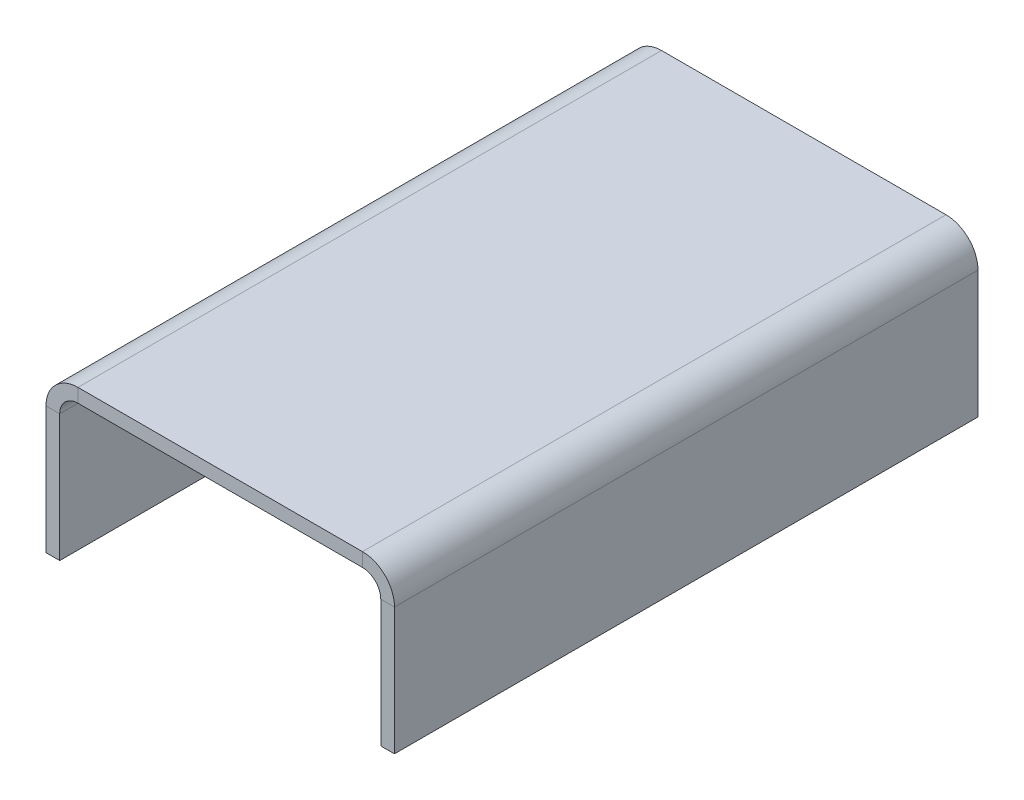
ISO-10303-21;
HEADER;
FILE_DESCRIPTION(('STEP AP214'),'2;1');
FILE_NAME('part.step','',(''),(''),'','','');
FILE_SCHEMA(('AUTOMOTIVE_DESIGN { 1 0 10303 214 1 1 1 1 }'));
ENDSEC;
DATA;
#1=APPLICATION_CONTEXT('core data for automotive mechanical design processes');
#2=APPLICATION_PROTOCOL_DEFINITION('international standard','automotive_design',2000,#1);
#3=PRODUCT_CONTEXT('',#1,'mechanical');
#4=PRODUCT('Part','Part','',(#3));
#5=PRODUCT_RELATED_PRODUCT_CATEGORY('part','',(#4));
#6=PRODUCT_DEFINITION_FORMATION('','',#4);
#7=PRODUCT_DEFINITION_CONTEXT('part definition',#1,'design');
#8=PRODUCT_DEFINITION('design','',#6,#7);
#9=PRODUCT_DEFINITION_SHAPE('','',#8);
#10=(LENGTH_UNIT() NAMED_UNIT(*) SI_UNIT(.MILLI.,.METRE.));
#11=(NAMED_UNIT(*) PLANE_ANGLE_UNIT() SI_UNIT($,.RADIAN.));
#12=(NAMED_UNIT(*) SI_UNIT($,.STERADIAN.) SOLID_ANGLE_UNIT());
#13=UNCERTAINTY_MEASURE_WITH_UNIT(LENGTH_MEASURE(1.E-05),#10,'distance_accuracy_value','');
#14=(GEOMETRIC_REPRESENTATION_CONTEXT(3) GLOBAL_UNCERTAINTY_ASSIGNED_CONTEXT((#13)) GLOBAL_UNIT_ASSIGNED_CONTEXT((#10,
#11,#12)) REPRESENTATION_CONTEXT('',''));
#15=CARTESIAN_POINT('',(0.,0.,0.));
#16=DIRECTION('',(0.,0.,1.));
#17=DIRECTION('',(1.,0.,0.));
#18=AXIS2_PLACEMENT_3D('',#15,#16,#17);
#19=CARTESIAN_POINT('',(-31.1,17.4,63.8));
#20=DIRECTION('',(0.,0.,1.));
#21=DIRECTION('',(1.,0.,0.));
#22=AXIS2_PLACEMENT_3D('',#19,#20,#21);
#23=PLANE('',#22);
#24=DIRECTION('',(0.,-1.,0.));
#25=VECTOR('',#24,1.);
#26=CARTESIAN_POINT('',(-31.1,17.4,63.8));
#27=LINE('',#26,#25);
#28=CARTESIAN_POINT('',(-31.1,17.4,63.8));
#29=VERTEX_POINT('',#28);
#30=CARTESIAN_POINT('',(-31.1,14.4,63.8));
#31=VERTEX_POINT('',#30);
#32=EDGE_CURVE('E11',#29,#31,#27,.T.);
#33=ORIENTED_EDGE('',*,*,#32,.F.);
#34=CARTESIAN_POINT('',(-31.1,10.4,63.8));
#35=DIRECTION('',(0.,0.,1.));
#36=DIRECTION('',(1.,0.,0.));
#37=AXIS2_PLACEMENT_3D('',#34,#35,#36);
#38=CIRCLE('',#37,7.);
#39=CARTESIAN_POINT('',(-38.1,10.4,63.8));
#40=VERTEX_POINT('',#39);
#41=EDGE_CURVE('E172',#29,#40,#38,.T.);
#42=ORIENTED_EDGE('',*,*,#41,.T.);
#43=DIRECTION('',(-1.,0.,0.));
#44=VECTOR('',#43,1.);
#45=CARTESIAN_POINT('',(-35.1,10.4,63.8));
#46=LINE('',#45,#44);
#47=CARTESIAN_POINT('',(-35.1,10.4,63.8));
#48=VERTEX_POINT('',#47);
#49=EDGE_CURVE('E47',#48,#40,#46,.T.);
#50=ORIENTED_EDGE('',*,*,#49,.F.);
#51=CARTESIAN_POINT('',(-31.1,10.4,63.8));
#52=DIRECTION('',(0.,0.,1.));
#53=DIRECTION('',(1.,0.,0.));
#54=AXIS2_PLACEMENT_3D('',#51,#52,#53);
#55=CIRCLE('',#54,4.);
#56=EDGE_CURVE('E248',#31,#48,#55,.T.);
#57=ORIENTED_EDGE('',*,*,#56,.F.);
#58=EDGE_LOOP('',(#33,#42,#50,#57));
#59=FACE_BOUND('',#58,.T.);
#60=ADVANCED_FACE('F39',(#59),#23,.T.);
#61=CARTESIAN_POINT('',(-35.1,10.4,63.8));
#62=DIRECTION('',(0.,0.,1.));
#63=DIRECTION('',(1.,0.,0.));
#64=AXIS2_PLACEMENT_3D('',#61,#62,#63);
#65=PLANE('',#64);
#66=DIRECTION('',(-1.,0.,0.));
#67=VECTOR('',#66,1.);
#68=CARTESIAN_POINT('',(-38.1,17.4,63.8));
#69=LINE('',#68,#67);
#70=CARTESIAN_POINT('',(31.0999999999999,17.4,63.8));
#71=VERTEX_POINT('',#70);
#72=EDGE_CURVE('E139',#71,#29,#69,.T.);
#73=ORIENTED_EDGE('',*,*,#72,.T.);
#74=ORIENTED_EDGE('',*,*,#32,.T.);
#75=DIRECTION('',(-1.,0.,0.));
#76=VECTOR('',#75,1.);
#77=CARTESIAN_POINT('',(-38.1,14.4,63.8));
#78=LINE('',#77,#76);
#79=CARTESIAN_POINT('',(31.0999999999999,14.4,63.8));
#80=VERTEX_POINT('',#79);
#81=EDGE_CURVE('E142',#80,#31,#78,.T.);
#82=ORIENTED_EDGE('',*,*,#81,.F.);
#83=DIRECTION('',(0.,1.,0.));
#84=VECTOR('',#83,1.);
#85=CARTESIAN_POINT('',(31.0999999999999,14.4,63.8));
#86=LINE('',#85,#84);
#87=EDGE_CURVE('E135',#80,#71,#86,.T.);
#88=ORIENTED_EDGE('',*,*,#87,.T.);
#89=EDGE_LOOP('',(#73,#74,#82,#88));
#90=FACE_BOUND('',#89,.T.);
#91=ADVANCED_FACE('F137',(#90),#65,.T.);
#92=CARTESIAN_POINT('',(-38.1,10.4,-63.8));
#93=DIRECTION('',(0.,0.,-1.));
#94=DIRECTION('',(-1.,0.,0.));
#95=AXIS2_PLACEMENT_3D('',#92,#93,#94);
#96=PLANE('',#95);
#97=DIRECTION('',(1.,0.,0.));
#98=VECTOR('',#97,1.);
#99=CARTESIAN_POINT('',(-38.1,10.4,-63.8));
#100=LINE('',#99,#98);
#101=CARTESIAN_POINT('',(-38.1,10.4,-63.8));
#102=VERTEX_POINT('',#101);
#103=CARTESIAN_POINT('',(-35.1,10.4,-63.8));
#104=VERTEX_POINT('',#103);
#105=EDGE_CURVE('E102',#102,#104,#100,.T.);
#106=ORIENTED_EDGE('',*,*,#105,.F.);
#107=CARTESIAN_POINT('',(-31.1,10.4,-63.8));
#108=DIRECTION('',(0.,0.,1.));
#109=DIRECTION('',(1.,0.,0.));
#110=AXIS2_PLACEMENT_3D('',#107,#108,#109);
#111=CIRCLE('',#110,7.);
#112=CARTESIAN_POINT('',(-31.1,17.4,-63.8));
#113=VERTEX_POINT('',#112);
#114=EDGE_CURVE('E206',#113,#102,#111,.T.);
#115=ORIENTED_EDGE('',*,*,#114,.F.);
#116=DIRECTION('',(0.,1.,0.));
#117=VECTOR('',#116,1.);
#118=CARTESIAN_POINT('',(-31.1,14.4,-63.8));
#119=LINE('',#118,#117);
#120=CARTESIAN_POINT('',(-31.1,14.4,-63.8));
#121=VERTEX_POINT('',#120);
#122=EDGE_CURVE('E95',#121,#113,#119,.T.);
#123=ORIENTED_EDGE('',*,*,#122,.F.);
#124=CARTESIAN_POINT('',(-31.1,10.4,-63.8));
#125=DIRECTION('',(0.,0.,1.));
#126=DIRECTION('',(1.,0.,0.));
#127=AXIS2_PLACEMENT_3D('',#124,#125,#126);
#128=CIRCLE('',#127,4.);
#129=EDGE_CURVE('E187',#121,#104,#128,.T.);
#130=ORIENTED_EDGE('',*,*,#129,.T.);
#131=EDGE_LOOP('',(#106,#115,#123,#130));
#132=FACE_BOUND('',#131,.T.);
#133=ADVANCED_FACE('F253',(#132),#96,.T.);
#134=CARTESIAN_POINT('',(-31.1,14.4,-63.8));
#135=DIRECTION('',(0.,0.,-1.));
#136=DIRECTION('',(-1.,0.,0.));
#137=AXIS2_PLACEMENT_3D('',#134,#135,#136);
#138=PLANE('',#137);
#139=DIRECTION('',(0.,-1.,0.));
#140=VECTOR('',#139,1.);
#141=CARTESIAN_POINT('',(-38.1,-17.4,-63.8));
#142=LINE('',#141,#140);
#143=CARTESIAN_POINT('',(-38.1,-17.4,-63.8));
#144=VERTEX_POINT('',#143);
#145=EDGE_CURVE('E178',#102,#144,#142,.T.);
#146=ORIENTED_EDGE('',*,*,#145,.F.);
#147=ORIENTED_EDGE('',*,*,#105,.T.);
#148=DIRECTION('',(0.,1.,0.));
#149=VECTOR('',#148,1.);
#150=CARTESIAN_POINT('',(-35.1,-17.4,-63.8));
#151=LINE('',#150,#149);
#152=CARTESIAN_POINT('',(-35.1,-17.4,-63.8));
#153=VERTEX_POINT('',#152);
#154=EDGE_CURVE('E184',#104,#153,#151,.F.);
#155=ORIENTED_EDGE('',*,*,#154,.T.);
#156=DIRECTION('',(-1.,0.,0.));
#157=VECTOR('',#156,1.);
#158=CARTESIAN_POINT('',(-35.1,-17.4,-63.8));
#159=LINE('',#158,#157);
#160=EDGE_CURVE('E181',#153,#144,#159,.T.);
#161=ORIENTED_EDGE('',*,*,#160,.T.);
#162=EDGE_LOOP('',(#146,#147,#155,#161));
#163=FACE_BOUND('',#162,.T.);
#164=ADVANCED_FACE('F239',(#163),#138,.T.);
#165=CARTESIAN_POINT('',(38.1,10.4,63.8));
#166=DIRECTION('',(0.,0.,1.));
#167=DIRECTION('',(1.,0.,0.));
#168=AXIS2_PLACEMENT_3D('',#165,#166,#167);
#169=PLANE('',#168);
#170=DIRECTION('',(-1.,0.,0.));
#171=VECTOR('',#170,1.);
#172=CARTESIAN_POINT('',(38.1,10.4,63.8));
#173=LINE('',#172,#171);
#174=CARTESIAN_POINT('',(38.1,10.4,63.8));
#175=VERTEX_POINT('',#174);
#176=CARTESIAN_POINT('',(35.1,10.4,63.8));
#177=VERTEX_POINT('',#176);
#178=EDGE_CURVE('E147',#175,#177,#173,.T.);
#179=ORIENTED_EDGE('',*,*,#178,.F.);
#180=CARTESIAN_POINT('',(31.1,10.4,63.8));
#181=DIRECTION('',(0.,0.,1.));
#182=DIRECTION('',(1.,0.,0.));
#183=AXIS2_PLACEMENT_3D('',#180,#181,#182);
#184=CIRCLE('',#183,7.);
#185=EDGE_CURVE('E151',#175,#71,#184,.T.);
#186=ORIENTED_EDGE('',*,*,#185,.T.);
#187=ORIENTED_EDGE('',*,*,#87,.F.);
#188=CARTESIAN_POINT('',(31.1,10.4,63.8));
#189=DIRECTION('',(0.,0.,1.));
#190=DIRECTION('',(1.,0.,0.));
#191=AXIS2_PLACEMENT_3D('',#188,#189,#190);
#192=CIRCLE('',#191,4.);
#193=EDGE_CURVE('E260',#177,#80,#192,.T.);
#194=ORIENTED_EDGE('',*,*,#193,.F.);
#195=EDGE_LOOP('',(#179,#186,#187,#194));
#196=FACE_BOUND('',#195,.T.);
#197=ADVANCED_FACE('F153',(#196),#169,.T.);
#198=CARTESIAN_POINT('',(31.0999999999999,14.4,63.8));
#199=DIRECTION('',(0.,0.,1.));
#200=DIRECTION('',(1.,0.,0.));
#201=AXIS2_PLACEMENT_3D('',#198,#199,#200);
#202=PLANE('',#201);
#203=DIRECTION('',(0.,1.,0.));
#204=VECTOR('',#203,1.);
#205=CARTESIAN_POINT('',(38.1,-17.4,63.8));
#206=LINE('',#205,#204);
#207=CARTESIAN_POINT('',(38.1,-17.4,63.8));
#208=VERTEX_POINT('',#207);
#209=EDGE_CURVE('E157',#208,#175,#206,.T.);
#210=ORIENTED_EDGE('',*,*,#209,.T.);
#211=ORIENTED_EDGE('',*,*,#178,.T.);
#212=DIRECTION('',(0.,1.,0.));
#213=VECTOR('',#212,1.);
#214=CARTESIAN_POINT('',(35.1,-17.4,63.8));
#215=LINE('',#214,#213);
#216=CARTESIAN_POINT('',(35.1,-17.4,63.8));
#217=VERTEX_POINT('',#216);
#218=EDGE_CURVE('E267',#217,#177,#215,.T.);
#219=ORIENTED_EDGE('',*,*,#218,.F.);
#220=DIRECTION('',(-1.,0.,0.));
#221=VECTOR('',#220,1.);
#222=CARTESIAN_POINT('',(38.1,-17.4,63.8));
#223=LINE('',#222,#221);
#224=EDGE_CURVE('E270',#208,#217,#223,.T.);
#225=ORIENTED_EDGE('',*,*,#224,.F.);
#226=EDGE_LOOP('',(#210,#211,#219,#225));
#227=FACE_BOUND('',#226,.T.);
#228=ADVANCED_FACE('F276',(#227),#202,.T.);
#229=CARTESIAN_POINT('',(31.0999999999999,17.4,-63.8));
#230=DIRECTION('',(0.,0.,-1.));
#231=DIRECTION('',(-1.,0.,0.));
#232=AXIS2_PLACEMENT_3D('',#229,#230,#231);
#233=PLANE('',#232);
#234=DIRECTION('',(0.,-1.,0.));
#235=VECTOR('',#234,1.);
#236=CARTESIAN_POINT('',(31.0999999999999,17.4,-63.8));
#237=LINE('',#236,#235);
#238=CARTESIAN_POINT('',(31.0999999999999,17.4,-63.8));
#239=VERTEX_POINT('',#238);
#240=CARTESIAN_POINT('',(31.0999999999999,14.4,-63.8));
#241=VERTEX_POINT('',#240);
#242=EDGE_CURVE('E148',#239,#241,#237,.T.);
#243=ORIENTED_EDGE('',*,*,#242,.F.);
#244=CARTESIAN_POINT('',(31.1,10.4,-63.8));
#245=DIRECTION('',(0.,0.,1.));
#246=DIRECTION('',(1.,0.,0.));
#247=AXIS2_PLACEMENT_3D('',#244,#245,#246);
#248=CIRCLE('',#247,7.);
#249=CARTESIAN_POINT('',(38.1,10.4,-63.8));
#250=VERTEX_POINT('',#249);
#251=EDGE_CURVE('E164',#250,#239,#248,.T.);
#252=ORIENTED_EDGE('',*,*,#251,.F.);
#253=DIRECTION('',(1.,0.,0.));
#254=VECTOR('',#253,1.);
#255=CARTESIAN_POINT('',(35.1,10.4,-63.8));
#256=LINE('',#255,#254);
#257=CARTESIAN_POINT('',(35.1,10.4,-63.8));
#258=VERTEX_POINT('',#257);
#259=EDGE_CURVE('E232',#258,#250,#256,.T.);
#260=ORIENTED_EDGE('',*,*,#259,.F.);
#261=CARTESIAN_POINT('',(31.1,10.4,-63.8));
#262=DIRECTION('',(0.,0.,1.));
#263=DIRECTION('',(1.,0.,0.));
#264=AXIS2_PLACEMENT_3D('',#261,#262,#263);
#265=CIRCLE('',#264,4.);
#266=EDGE_CURVE('E191',#258,#241,#265,.T.);
#267=ORIENTED_EDGE('',*,*,#266,.T.);
#268=EDGE_LOOP('',(#243,#252,#260,#267));
#269=FACE_BOUND('',#268,.T.);
#270=ADVANCED_FACE('F283',(#269),#233,.T.);
#271=CARTESIAN_POINT('',(35.1,10.4,-63.8));
#272=DIRECTION('',(0.,0.,-1.));
#273=DIRECTION('',(-1.,0.,0.));
#274=AXIS2_PLACEMENT_3D('',#271,#272,#273);
#275=PLANE('',#274);
#276=DIRECTION('',(-1.,0.,0.));
#277=VECTOR('',#276,1.);
#278=CARTESIAN_POINT('',(-38.1,17.4,-63.8));
#279=LINE('',#278,#277);
#280=EDGE_CURVE('E204',#239,#113,#279,.T.);
#281=ORIENTED_EDGE('',*,*,#280,.F.);
#282=ORIENTED_EDGE('',*,*,#242,.T.);
#283=DIRECTION('',(-1.,0.,0.));
#284=VECTOR('',#283,1.);
#285=CARTESIAN_POINT('',(-38.1,14.4,-63.8));
#286=LINE('',#285,#284);
#287=EDGE_CURVE('E189',#241,#121,#286,.T.);
#288=ORIENTED_EDGE('',*,*,#287,.T.);
#289=ORIENTED_EDGE('',*,*,#122,.T.);
#290=EDGE_LOOP('',(#281,#282,#288,#289));
#291=FACE_BOUND('',#290,.T.);
#292=ADVANCED_FACE('F285',(#291),#275,.T.);
#293=CARTESIAN_POINT('',(-38.1,-17.4,63.8));
#294=DIRECTION('',(1.,0.,0.));
#295=DIRECTION('',(0.,0.,-1.));
#296=AXIS2_PLACEMENT_3D('',#293,#294,#295);
#297=PLANE('',#296);
#298=ORIENTED_EDGE('',*,*,#145,.T.);
#299=DIRECTION('',(0.,0.,-1.));
#300=VECTOR('',#299,1.);
#301=CARTESIAN_POINT('',(-38.1,-17.4,63.8));
#302=LINE('',#301,#300);
#303=CARTESIAN_POINT('',(-38.1,-17.4,63.8));
#304=VERTEX_POINT('',#303);
#305=EDGE_CURVE('E230',#304,#144,#302,.T.);
#306=ORIENTED_EDGE('',*,*,#305,.F.);
#307=DIRECTION('',(0.,-1.,0.));
#308=VECTOR('',#307,1.);
#309=CARTESIAN_POINT('',(-38.1,-17.4,63.8));
#310=LINE('',#309,#308);
#311=EDGE_CURVE('E108',#40,#304,#310,.T.);
#312=ORIENTED_EDGE('',*,*,#311,.F.);
#313=DIRECTION('',(0.,0.,-1.));
#314=VECTOR('',#313,1.);
#315=CARTESIAN_POINT('',(-38.1,10.4,63.8));
#316=LINE('',#315,#314);
#317=EDGE_CURVE('E174',#40,#102,#316,.T.);
#318=ORIENTED_EDGE('',*,*,#317,.T.);
#319=EDGE_LOOP('',(#298,#306,#312,#318));
#320=FACE_BOUND('',#319,.T.);
#321=ADVANCED_FACE('F324',(#320),#297,.F.);
#322=CARTESIAN_POINT('',(-35.1,-17.4,63.8));
#323=DIRECTION('',(0.,-1.,0.));
#324=DIRECTION('',(0.,0.,-1.));
#325=AXIS2_PLACEMENT_3D('',#322,#323,#324);
#326=PLANE('',#325);
#327=ORIENTED_EDGE('',*,*,#160,.F.);
#328=DIRECTION('',(0.,0.,-1.));
#329=VECTOR('',#328,1.);
#330=CARTESIAN_POINT('',(-35.1,-17.4,63.8));
#331=LINE('',#330,#329);
#332=CARTESIAN_POINT('',(-35.1,-17.4,63.8));
#333=VERTEX_POINT('',#332);
#334=EDGE_CURVE('E228',#333,#153,#331,.T.);
#335=ORIENTED_EDGE('',*,*,#334,.F.);
#336=DIRECTION('',(-1.,0.,0.));
#337=VECTOR('',#336,1.);
#338=CARTESIAN_POINT('',(-35.1,-17.4,63.8));
#339=LINE('',#338,#337);
#340=EDGE_CURVE('E262',#333,#304,#339,.T.);
#341=ORIENTED_EDGE('',*,*,#340,.T.);
#342=ORIENTED_EDGE('',*,*,#305,.T.);
#343=EDGE_LOOP('',(#327,#335,#341,#342));
#344=FACE_BOUND('',#343,.T.);
#345=ADVANCED_FACE('F327',(#344),#326,.T.);
#346=CARTESIAN_POINT('',(-35.1,-17.4,63.8));
#347=DIRECTION('',(1.,0.,0.));
#348=DIRECTION('',(0.,0.,-1.));
#349=AXIS2_PLACEMENT_3D('',#346,#347,#348);
#350=PLANE('',#349);
#351=ORIENTED_EDGE('',*,*,#154,.F.);
#352=DIRECTION('',(0.,0.,-1.));
#353=VECTOR('',#352,1.);
#354=CARTESIAN_POINT('',(-35.1,10.4,63.8));
#355=LINE('',#354,#353);
#356=EDGE_CURVE('E225',#48,#104,#355,.T.);
#357=ORIENTED_EDGE('',*,*,#356,.F.);
#358=DIRECTION('',(0.,1.,0.));
#359=VECTOR('',#358,1.);
#360=CARTESIAN_POINT('',(-35.1,-17.4,63.8));
#361=LINE('',#360,#359);
#362=EDGE_CURVE('E258',#48,#333,#361,.F.);
#363=ORIENTED_EDGE('',*,*,#362,.T.);
#364=ORIENTED_EDGE('',*,*,#334,.T.);
#365=EDGE_LOOP('',(#351,#357,#363,#364));
#366=FACE_BOUND('',#365,.T.);
#367=ADVANCED_FACE('F251',(#366),#350,.T.);
#368=CARTESIAN_POINT('',(-31.1,10.4,63.8));
#369=DIRECTION('',(0.,0.,-1.));
#370=DIRECTION('',(-1.,0.,0.));
#371=AXIS2_PLACEMENT_3D('',#368,#369,#370);
#372=CYLINDRICAL_SURFACE('',#371,4.);
#373=ORIENTED_EDGE('',*,*,#129,.F.);
#374=DIRECTION('',(0.,0.,-1.));
#375=VECTOR('',#374,1.);
#376=CARTESIAN_POINT('',(-31.1,14.4,63.8));
#377=LINE('',#376,#375);
#378=EDGE_CURVE('E222',#31,#121,#377,.T.);
#379=ORIENTED_EDGE('',*,*,#378,.F.);
#380=ORIENTED_EDGE('',*,*,#56,.T.);
#381=ORIENTED_EDGE('',*,*,#356,.T.);
#382=EDGE_LOOP('',(#373,#379,#380,#381));
#383=FACE_BOUND('',#382,.T.);
#384=ADVANCED_FACE('F245',(#383),#372,.F.);
#385=CARTESIAN_POINT('',(-38.1,14.4,63.8));
#386=DIRECTION('',(0.,-1.,0.));
#387=DIRECTION('',(1.,0.,0.));
#388=AXIS2_PLACEMENT_3D('',#385,#386,#387);
#389=PLANE('',#388);
#390=ORIENTED_EDGE('',*,*,#287,.F.);
#391=DIRECTION('',(0.,0.,-1.));
#392=VECTOR('',#391,1.);
#393=CARTESIAN_POINT('',(31.0999999999999,14.4,63.8));
#394=LINE('',#393,#392);
#395=EDGE_CURVE('E219',#80,#241,#394,.T.);
#396=ORIENTED_EDGE('',*,*,#395,.F.);
#397=ORIENTED_EDGE('',*,*,#81,.T.);
#398=ORIENTED_EDGE('',*,*,#378,.T.);
#399=EDGE_LOOP('',(#390,#396,#397,#398));
#400=FACE_BOUND('',#399,.T.);
#401=ADVANCED_FACE('F256',(#400),#389,.T.);
#402=CARTESIAN_POINT('',(31.1,10.4,63.8));
#403=DIRECTION('',(0.,0.,-1.));
#404=DIRECTION('',(-1.,0.,0.));
#405=AXIS2_PLACEMENT_3D('',#402,#403,#404);
#406=CYLINDRICAL_SURFACE('',#405,4.);
#407=ORIENTED_EDGE('',*,*,#266,.F.);
#408=DIRECTION('',(0.,0.,-1.));
#409=VECTOR('',#408,1.);
#410=CARTESIAN_POINT('',(35.1,10.4,63.8));
#411=LINE('',#410,#409);
#412=EDGE_CURVE('E216',#177,#258,#411,.T.);
#413=ORIENTED_EDGE('',*,*,#412,.F.);
#414=ORIENTED_EDGE('',*,*,#193,.T.);
#415=ORIENTED_EDGE('',*,*,#395,.T.);
#416=EDGE_LOOP('',(#407,#413,#414,#415));
#417=FACE_BOUND('',#416,.T.);
#418=ADVANCED_FACE('F287',(#417),#406,.F.);
#419=CARTESIAN_POINT('',(35.1,-17.4,63.8));
#420=DIRECTION('',(-1.,0.,0.));
#421=DIRECTION('',(0.,-1.,0.));
#422=AXIS2_PLACEMENT_3D('',#419,#420,#421);
#423=PLANE('',#422);
#424=DIRECTION('',(0.,1.,0.));
#425=VECTOR('',#424,1.);
#426=CARTESIAN_POINT('',(35.1,-17.4,-63.8));
#427=LINE('',#426,#425);
#428=CARTESIAN_POINT('',(35.1,-17.4,-63.8));
#429=VERTEX_POINT('',#428);
#430=EDGE_CURVE('E194',#429,#258,#427,.T.);
#431=ORIENTED_EDGE('',*,*,#430,.F.);
#432=DIRECTION('',(0.,0.,-1.));
#433=VECTOR('',#432,1.);
#434=CARTESIAN_POINT('',(35.1,-17.4,63.8));
#435=LINE('',#434,#433);
#436=EDGE_CURVE('E214',#217,#429,#435,.T.);
#437=ORIENTED_EDGE('',*,*,#436,.F.);
#438=ORIENTED_EDGE('',*,*,#218,.T.);
#439=ORIENTED_EDGE('',*,*,#412,.T.);
#440=EDGE_LOOP('',(#431,#437,#438,#439));
#441=FACE_BOUND('',#440,.T.);
#442=ADVANCED_FACE('F290',(#441),#423,.T.);
#443=CARTESIAN_POINT('',(38.1,-17.4,63.8));
#444=DIRECTION('',(0.,-1.,0.));
#445=DIRECTION('',(0.,0.,-1.));
#446=AXIS2_PLACEMENT_3D('',#443,#444,#445);
#447=PLANE('',#446);
#448=DIRECTION('',(-1.,0.,0.));
#449=VECTOR('',#448,1.);
#450=CARTESIAN_POINT('',(38.1,-17.4,-63.8));
#451=LINE('',#450,#449);
#452=CARTESIAN_POINT('',(38.1,-17.4,-63.8));
#453=VERTEX_POINT('',#452);
#454=EDGE_CURVE('E197',#453,#429,#451,.T.);
#455=ORIENTED_EDGE('',*,*,#454,.F.);
#456=DIRECTION('',(0.,0.,-1.));
#457=VECTOR('',#456,1.);
#458=CARTESIAN_POINT('',(38.1,-17.4,63.8));
#459=LINE('',#458,#457);
#460=EDGE_CURVE('E212',#208,#453,#459,.T.);
#461=ORIENTED_EDGE('',*,*,#460,.F.);
#462=ORIENTED_EDGE('',*,*,#224,.T.);
#463=ORIENTED_EDGE('',*,*,#436,.T.);
#464=EDGE_LOOP('',(#455,#461,#462,#463));
#465=FACE_BOUND('',#464,.T.);
#466=ADVANCED_FACE('F293',(#465),#447,.T.);
#467=CARTESIAN_POINT('',(38.1,-17.4,63.8));
#468=DIRECTION('',(-1.,0.,0.));
#469=DIRECTION('',(0.,-1.,0.));
#470=AXIS2_PLACEMENT_3D('',#467,#468,#469);
#471=PLANE('',#470);
#472=DIRECTION('',(0.,1.,0.));
#473=VECTOR('',#472,1.);
#474=CARTESIAN_POINT('',(38.1,-17.4,-63.8));
#475=LINE('',#474,#473);
#476=EDGE_CURVE('E200',#453,#250,#475,.T.);
#477=ORIENTED_EDGE('',*,*,#476,.T.);
#478=DIRECTION('',(0.,0.,-1.));
#479=VECTOR('',#478,1.);
#480=CARTESIAN_POINT('',(38.1,10.4,63.8));
#481=LINE('',#480,#479);
#482=EDGE_CURVE('E166',#175,#250,#481,.T.);
#483=ORIENTED_EDGE('',*,*,#482,.F.);
#484=ORIENTED_EDGE('',*,*,#209,.F.);
#485=ORIENTED_EDGE('',*,*,#460,.T.);
#486=EDGE_LOOP('',(#477,#483,#484,#485));
#487=FACE_BOUND('',#486,.T.);
#488=ADVANCED_FACE('F280',(#487),#471,.F.);
#489=CARTESIAN_POINT('',(31.1,10.4,63.8));
#490=DIRECTION('',(0.,0.,-1.));
#491=DIRECTION('',(-1.,0.,0.));
#492=AXIS2_PLACEMENT_3D('',#489,#490,#491);
#493=CYLINDRICAL_SURFACE('',#492,7.);
#494=ORIENTED_EDGE('',*,*,#251,.T.);
#495=DIRECTION('',(0.,0.,-1.));
#496=VECTOR('',#495,1.);
#497=CARTESIAN_POINT('',(31.0999999999999,17.4,63.8));
#498=LINE('',#497,#496);
#499=EDGE_CURVE('E161',#71,#239,#498,.T.);
#500=ORIENTED_EDGE('',*,*,#499,.F.);
#501=ORIENTED_EDGE('',*,*,#185,.F.);
#502=ORIENTED_EDGE('',*,*,#482,.T.);
#503=EDGE_LOOP('',(#494,#500,#501,#502));
#504=FACE_BOUND('',#503,.T.);
#505=ADVANCED_FACE('F162',(#504),#493,.T.);
#506=CARTESIAN_POINT('',(-38.1,17.4,63.8));
#507=DIRECTION('',(0.,-1.,0.));
#508=DIRECTION('',(1.,0.,0.));
#509=AXIS2_PLACEMENT_3D('',#506,#507,#508);
#510=PLANE('',#509);
#511=ORIENTED_EDGE('',*,*,#280,.T.);
#512=DIRECTION('',(0.,0.,-1.));
#513=VECTOR('',#512,1.);
#514=CARTESIAN_POINT('',(-31.1,17.4,63.8));
#515=LINE('',#514,#513);
#516=EDGE_CURVE('E167',#29,#113,#515,.T.);
#517=ORIENTED_EDGE('',*,*,#516,.F.);
#518=ORIENTED_EDGE('',*,*,#72,.F.);
#519=ORIENTED_EDGE('',*,*,#499,.T.);
#520=EDGE_LOOP('',(#511,#517,#518,#519));
#521=FACE_BOUND('',#520,.T.);
#522=ADVANCED_FACE('F169',(#521),#510,.F.);
#523=CARTESIAN_POINT('',(-31.1,10.4,63.8));
#524=DIRECTION('',(0.,0.,-1.));
#525=DIRECTION('',(-1.,0.,0.));
#526=AXIS2_PLACEMENT_3D('',#523,#524,#525);
#527=CYLINDRICAL_SURFACE('',#526,7.);
#528=ORIENTED_EDGE('',*,*,#114,.T.);
#529=ORIENTED_EDGE('',*,*,#317,.F.);
#530=ORIENTED_EDGE('',*,*,#41,.F.);
#531=ORIENTED_EDGE('',*,*,#516,.T.);
#532=EDGE_LOOP('',(#528,#529,#530,#531));
#533=FACE_BOUND('',#532,.T.);
#534=ADVANCED_FACE('F302',(#533),#527,.T.);
#535=CARTESIAN_POINT('',(-31.1,10.4,63.8));
#536=DIRECTION('',(0.,0.,1.));
#537=DIRECTION('',(1.,0.,0.));
#538=AXIS2_PLACEMENT_3D('',#535,#536,#537);
#539=PLANE('',#538);
#540=ORIENTED_EDGE('',*,*,#311,.T.);
#541=ORIENTED_EDGE('',*,*,#340,.F.);
#542=ORIENTED_EDGE('',*,*,#362,.F.);
#543=ORIENTED_EDGE('',*,*,#49,.T.);
#544=EDGE_LOOP('',(#540,#541,#542,#543));
#545=FACE_BOUND('',#544,.T.);
#546=ADVANCED_FACE('F297',(#545),#539,.T.);
#547=CARTESIAN_POINT('',(-31.1,10.4,-63.8));
#548=DIRECTION('',(0.,0.,1.));
#549=DIRECTION('',(1.,0.,0.));
#550=AXIS2_PLACEMENT_3D('',#547,#548,#549);
#551=PLANE('',#550);
#552=ORIENTED_EDGE('',*,*,#430,.T.);
#553=ORIENTED_EDGE('',*,*,#259,.T.);
#554=ORIENTED_EDGE('',*,*,#476,.F.);
#555=ORIENTED_EDGE('',*,*,#454,.T.);
#556=EDGE_LOOP('',(#552,#553,#554,#555));
#557=FACE_BOUND('',#556,.T.);
#558=ADVANCED_FACE('F295',(#557),#551,.F.);
#559=CLOSED_SHELL('',(#60,#91,#133,#164,#197,#228,#270,#292,#321,#345,#367,#384,#401,#418,#442,
#466,#488,#505,#522,#534,#546,#558));
#560=MANIFOLD_SOLID_BREP('B2',#559);
#561=ADVANCED_BREP_SHAPE_REPRESENTATION('',(#18,#560),#14);
#562=SHAPE_DEFINITION_REPRESENTATION(#9,#561);
ENDSEC;
END-ISO-10303-21;
